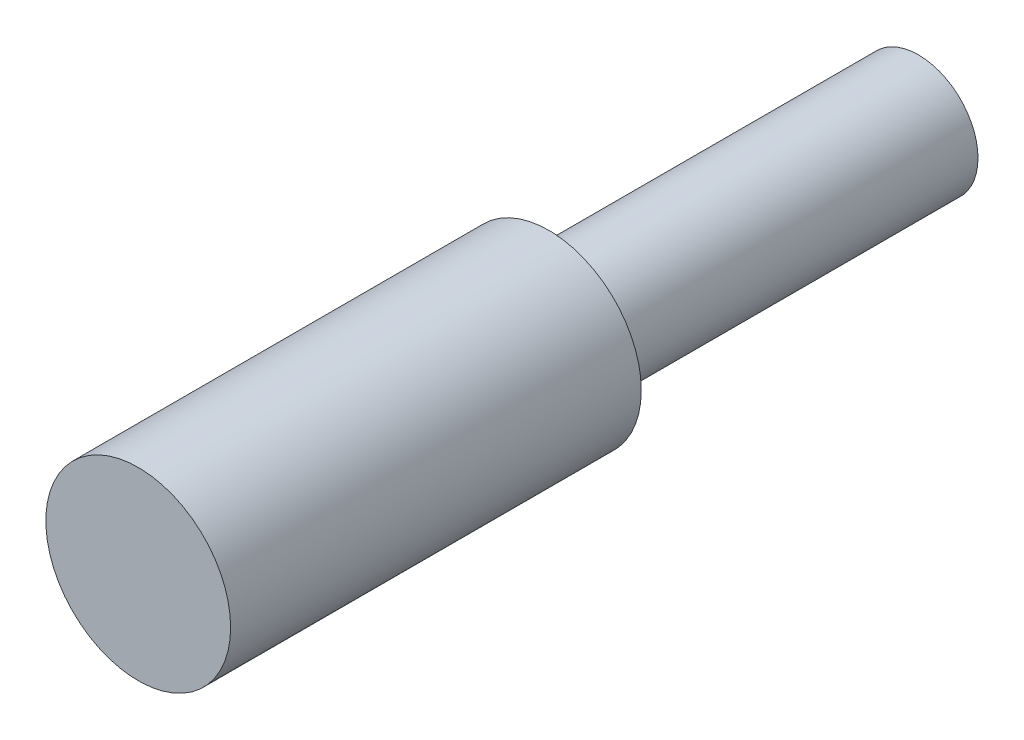
ISO-10303-21;
HEADER;
FILE_DESCRIPTION(('STEP AP214'),'2;1');
FILE_NAME('part.step','',(''),(''),'','','');
FILE_SCHEMA(('AUTOMOTIVE_DESIGN { 1 0 10303 214 1 1 1 1 }'));
ENDSEC;
DATA;
#1=APPLICATION_CONTEXT('core data for automotive mechanical design processes');
#2=APPLICATION_PROTOCOL_DEFINITION('international standard','automotive_design',2000,#1);
#3=PRODUCT_CONTEXT('',#1,'mechanical');
#4=PRODUCT('Part','Part','',(#3));
#5=PRODUCT_RELATED_PRODUCT_CATEGORY('part','',(#4));
#6=PRODUCT_DEFINITION_FORMATION('','',#4);
#7=PRODUCT_DEFINITION_CONTEXT('part definition',#1,'design');
#8=PRODUCT_DEFINITION('design','',#6,#7);
#9=PRODUCT_DEFINITION_SHAPE('','',#8);
#10=(LENGTH_UNIT() NAMED_UNIT(*) SI_UNIT(.MILLI.,.METRE.));
#11=(NAMED_UNIT(*) PLANE_ANGLE_UNIT() SI_UNIT($,.RADIAN.));
#12=(NAMED_UNIT(*) SI_UNIT($,.STERADIAN.) SOLID_ANGLE_UNIT());
#13=UNCERTAINTY_MEASURE_WITH_UNIT(LENGTH_MEASURE(1.E-05),#10,'distance_accuracy_value','');
#14=(GEOMETRIC_REPRESENTATION_CONTEXT(3) GLOBAL_UNCERTAINTY_ASSIGNED_CONTEXT((#13)) GLOBAL_UNIT_ASSIGNED_CONTEXT((#10,
#11,#12)) REPRESENTATION_CONTEXT('',''));
#15=CARTESIAN_POINT('',(0.,0.,0.));
#16=DIRECTION('',(0.,0.,1.));
#17=DIRECTION('',(1.,0.,0.));
#18=AXIS2_PLACEMENT_3D('',#15,#16,#17);
#19=CARTESIAN_POINT('',(0.,0.,0.));
#20=DIRECTION('',(0.,0.,1.));
#21=DIRECTION('',(1.,0.,0.));
#22=AXIS2_PLACEMENT_3D('',#19,#20,#21);
#23=PLANE('',#22);
#24=CARTESIAN_POINT('',(0.,0.,0.));
#25=DIRECTION('',(0.,0.,1.));
#26=DIRECTION('',(1.,0.,0.));
#27=AXIS2_PLACEMENT_3D('',#24,#25,#26);
#28=CIRCLE('',#27,2.25);
#29=CARTESIAN_POINT('',(2.25,0.,0.));
#30=VERTEX_POINT('',#29);
#31=EDGE_CURVE('E41',#30,#30,#28,.T.);
#32=ORIENTED_EDGE('',*,*,#31,.F.);
#33=EDGE_LOOP('',(#32));
#34=FACE_BOUND('',#33,.T.);
#35=CARTESIAN_POINT('',(0.,0.,0.));
#36=DIRECTION('',(0.,0.,1.));
#37=DIRECTION('',(1.,0.,0.));
#38=AXIS2_PLACEMENT_3D('',#35,#36,#37);
#39=CIRCLE('',#38,1.45);
#40=CARTESIAN_POINT('',(1.45,0.,0.));
#41=VERTEX_POINT('',#40);
#42=EDGE_CURVE('E10',#41,#41,#39,.F.);
#43=ORIENTED_EDGE('',*,*,#42,.F.);
#44=EDGE_LOOP('',(#43));
#45=FACE_BOUND('',#44,.T.);
#46=ADVANCED_FACE('F30',(#34,#45),#23,.F.);
#47=CARTESIAN_POINT('',(0.,0.,10.));
#48=DIRECTION('',(0.,0.,-1.));
#49=DIRECTION('',(-1.,0.,0.));
#50=AXIS2_PLACEMENT_3D('',#47,#48,#49);
#51=CYLINDRICAL_SURFACE('',#50,2.25);
#52=CARTESIAN_POINT('',(0.,0.,10.));
#53=DIRECTION('',(0.,0.,1.));
#54=DIRECTION('',(1.,0.,0.));
#55=AXIS2_PLACEMENT_3D('',#52,#53,#54);
#56=CIRCLE('',#55,2.25);
#57=CARTESIAN_POINT('',(2.25,0.,10.));
#58=VERTEX_POINT('',#57);
#59=EDGE_CURVE('E37',#58,#58,#56,.T.);
#60=ORIENTED_EDGE('',*,*,#59,.F.);
#61=EDGE_LOOP('',(#60));
#62=FACE_BOUND('',#61,.T.);
#63=ORIENTED_EDGE('',*,*,#31,.T.);
#64=EDGE_LOOP('',(#63));
#65=FACE_BOUND('',#64,.T.);
#66=ADVANCED_FACE('F32',(#62,#65),#51,.T.);
#67=CARTESIAN_POINT('',(0.,0.,10.));
#68=DIRECTION('',(0.,0.,1.));
#69=DIRECTION('',(1.,0.,0.));
#70=AXIS2_PLACEMENT_3D('',#67,#68,#69);
#71=PLANE('',#70);
#72=ORIENTED_EDGE('',*,*,#59,.T.);
#73=EDGE_LOOP('',(#72));
#74=FACE_BOUND('',#73,.T.);
#75=ADVANCED_FACE('F55',(#74),#71,.T.);
#76=CARTESIAN_POINT('',(0.,0.,-9.));
#77=DIRECTION('',(0.,0.,1.));
#78=DIRECTION('',(1.,0.,0.));
#79=AXIS2_PLACEMENT_3D('',#76,#77,#78);
#80=CYLINDRICAL_SURFACE('',#79,1.45);
#81=CARTESIAN_POINT('',(0.,0.,-9.));
#82=DIRECTION('',(0.,0.,-1.));
#83=DIRECTION('',(-1.,0.,0.));
#84=AXIS2_PLACEMENT_3D('',#81,#82,#83);
#85=CIRCLE('',#84,1.45);
#86=CARTESIAN_POINT('',(-1.45,0.,-9.));
#87=VERTEX_POINT('',#86);
#88=EDGE_CURVE('E46',#87,#87,#85,.T.);
#89=ORIENTED_EDGE('',*,*,#88,.F.);
#90=EDGE_LOOP('',(#89));
#91=FACE_BOUND('',#90,.T.);
#92=ORIENTED_EDGE('',*,*,#42,.T.);
#93=EDGE_LOOP('',(#92));
#94=FACE_BOUND('',#93,.T.);
#95=ADVANCED_FACE('F53',(#91,#94),#80,.T.);
#96=CARTESIAN_POINT('',(0.,0.,-9.));
#97=DIRECTION('',(0.,0.,-1.));
#98=DIRECTION('',(-1.,0.,0.));
#99=AXIS2_PLACEMENT_3D('',#96,#97,#98);
#100=PLANE('',#99);
#101=ORIENTED_EDGE('',*,*,#88,.T.);
#102=EDGE_LOOP('',(#101));
#103=FACE_BOUND('',#102,.T.);
#104=ADVANCED_FACE('F51',(#103),#100,.T.);
#105=CLOSED_SHELL('',(#46,#66,#75,#95,#104));
#106=MANIFOLD_SOLID_BREP('B2',#105);
#107=ADVANCED_BREP_SHAPE_REPRESENTATION('',(#18,#106),#14);
#108=SHAPE_DEFINITION_REPRESENTATION(#9,#107);
ENDSEC;
END-ISO-10303-21;
